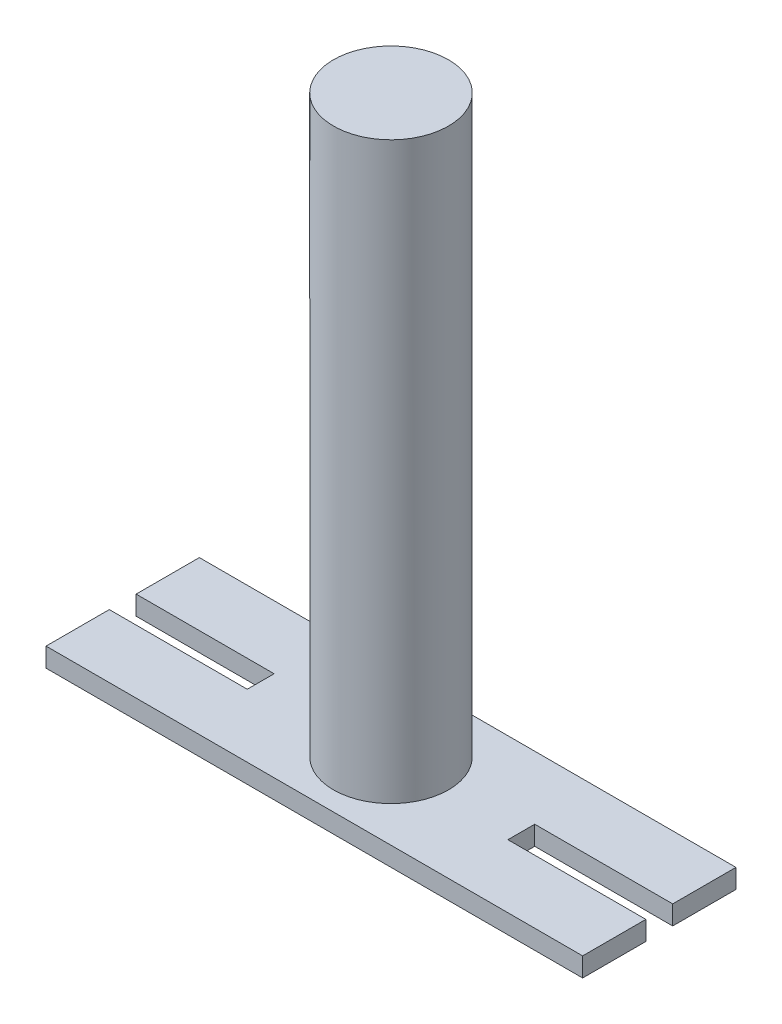
ISO-10303-21;
HEADER;
FILE_DESCRIPTION(('STEP AP214'),'2;1');
FILE_NAME('part.step','',(''),(''),'','','');
FILE_SCHEMA(('AUTOMOTIVE_DESIGN { 1 0 10303 214 1 1 1 1 }'));
ENDSEC;
DATA;
#1=APPLICATION_CONTEXT('core data for automotive mechanical design processes');
#2=APPLICATION_PROTOCOL_DEFINITION('international standard','automotive_design',2000,#1);
#3=PRODUCT_CONTEXT('',#1,'mechanical');
#4=PRODUCT('Part','Part','',(#3));
#5=PRODUCT_RELATED_PRODUCT_CATEGORY('part','',(#4));
#6=PRODUCT_DEFINITION_FORMATION('','',#4);
#7=PRODUCT_DEFINITION_CONTEXT('part definition',#1,'design');
#8=PRODUCT_DEFINITION('design','',#6,#7);
#9=PRODUCT_DEFINITION_SHAPE('','',#8);
#10=(LENGTH_UNIT() NAMED_UNIT(*) SI_UNIT(.MILLI.,.METRE.));
#11=(NAMED_UNIT(*) PLANE_ANGLE_UNIT() SI_UNIT($,.RADIAN.));
#12=(NAMED_UNIT(*) SI_UNIT($,.STERADIAN.) SOLID_ANGLE_UNIT());
#13=UNCERTAINTY_MEASURE_WITH_UNIT(LENGTH_MEASURE(1.E-05),#10,'distance_accuracy_value','');
#14=(GEOMETRIC_REPRESENTATION_CONTEXT(3) GLOBAL_UNCERTAINTY_ASSIGNED_CONTEXT((#13)) GLOBAL_UNIT_ASSIGNED_CONTEXT((#10,
#11,#12)) REPRESENTATION_CONTEXT('',''));
#15=CARTESIAN_POINT('',(0.,0.,0.));
#16=DIRECTION('',(0.,0.,1.));
#17=DIRECTION('',(1.,0.,0.));
#18=AXIS2_PLACEMENT_3D('',#15,#16,#17);
#19=CARTESIAN_POINT('',(0.,127.,0.));
#20=DIRECTION('',(0.,1.,0.));
#21=DIRECTION('',(0.,0.,1.));
#22=AXIS2_PLACEMENT_3D('',#19,#20,#21);
#23=PLANE('',#22);
#24=CARTESIAN_POINT('',(0.,127.,0.));
#25=DIRECTION('',(0.,1.,0.));
#26=DIRECTION('',(0.,0.,1.));
#27=AXIS2_PLACEMENT_3D('',#24,#25,#26);
#28=CIRCLE('',#27,381.);
#29=CARTESIAN_POINT('',(0.,127.,381.));
#30=VERTEX_POINT('',#29);
#31=EDGE_CURVE('E12',#30,#30,#28,.T.);
#32=ORIENTED_EDGE('',*,*,#31,.F.);
#33=EDGE_LOOP('',(#32));
#34=FACE_BOUND('',#33,.T.);
#35=DIRECTION('',(0.,0.,1.));
#36=VECTOR('',#35,1.);
#37=CARTESIAN_POINT('',(1778.,127.,9.42007414833465E-13));
#38=LINE('',#37,#36);
#39=CARTESIAN_POINT('',(1778.,127.,88.8999999999994));
#40=VERTEX_POINT('',#39);
#41=CARTESIAN_POINT('',(1778.,127.,508.));
#42=VERTEX_POINT('',#41);
#43=EDGE_CURVE('E221',#40,#42,#38,.T.);
#44=ORIENTED_EDGE('',*,*,#43,.F.);
#45=DIRECTION('',(-1.,0.,0.));
#46=VECTOR('',#45,1.);
#47=CARTESIAN_POINT('',(0.,127.,88.9000000000002));
#48=LINE('',#47,#46);
#49=CARTESIAN_POINT('',(863.6,127.,88.8999999999998));
#50=VERTEX_POINT('',#49);
#51=EDGE_CURVE('E245',#40,#50,#48,.T.);
#52=ORIENTED_EDGE('',*,*,#51,.T.);
#53=DIRECTION('',(0.,0.,-1.));
#54=VECTOR('',#53,1.);
#55=CARTESIAN_POINT('',(863.6,127.,-1.07850236677872E-12));
#56=LINE('',#55,#54);
#57=CARTESIAN_POINT('',(863.6,127.,-88.9000000000004));
#58=VERTEX_POINT('',#57);
#59=EDGE_CURVE('E313',#50,#58,#56,.T.);
#60=ORIENTED_EDGE('',*,*,#59,.T.);
#61=DIRECTION('',(-1.,0.,0.));
#62=VECTOR('',#61,1.);
#63=CARTESIAN_POINT('',(0.,127.,-88.9000000000004));
#64=LINE('',#63,#62);
#65=CARTESIAN_POINT('',(1778.,127.,-88.9000000000004));
#66=VERTEX_POINT('',#65);
#67=EDGE_CURVE('E309',#66,#58,#64,.T.);
#68=ORIENTED_EDGE('',*,*,#67,.F.);
#69=DIRECTION('',(0.,0.,1.));
#70=VECTOR('',#69,1.);
#71=CARTESIAN_POINT('',(1778.,127.,0.));
#72=LINE('',#71,#70);
#73=CARTESIAN_POINT('',(1778.,127.,-508.));
#74=VERTEX_POINT('',#73);
#75=EDGE_CURVE('E312',#74,#66,#72,.T.);
#76=ORIENTED_EDGE('',*,*,#75,.F.);
#77=DIRECTION('',(-1.,0.,0.));
#78=VECTOR('',#77,1.);
#79=CARTESIAN_POINT('',(0.,127.,-508.));
#80=LINE('',#79,#78);
#81=CARTESIAN_POINT('',(-1778.,127.,-508.));
#82=VERTEX_POINT('',#81);
#83=EDGE_CURVE('E315',#74,#82,#80,.T.);
#84=ORIENTED_EDGE('',*,*,#83,.T.);
#85=DIRECTION('',(0.,0.,1.));
#86=VECTOR('',#85,1.);
#87=CARTESIAN_POINT('',(-1778.,127.,0.));
#88=LINE('',#87,#86);
#89=CARTESIAN_POINT('',(-1778.,127.,-88.9));
#90=VERTEX_POINT('',#89);
#91=EDGE_CURVE('E321',#82,#90,#88,.T.);
#92=ORIENTED_EDGE('',*,*,#91,.T.);
#93=DIRECTION('',(1.,0.,0.));
#94=VECTOR('',#93,1.);
#95=CARTESIAN_POINT('',(0.,127.,-88.9000000000004));
#96=LINE('',#95,#94);
#97=CARTESIAN_POINT('',(-863.6,127.,-88.9000000000002));
#98=VERTEX_POINT('',#97);
#99=EDGE_CURVE('E186',#90,#98,#96,.T.);
#100=ORIENTED_EDGE('',*,*,#99,.T.);
#101=DIRECTION('',(0.,0.,-1.));
#102=VECTOR('',#101,1.);
#103=CARTESIAN_POINT('',(-863.6,127.,0.));
#104=LINE('',#103,#102);
#105=CARTESIAN_POINT('',(-863.6,127.,88.9000000000002));
#106=VERTEX_POINT('',#105);
#107=EDGE_CURVE('E184',#106,#98,#104,.T.);
#108=ORIENTED_EDGE('',*,*,#107,.F.);
#109=DIRECTION('',(1.,0.,0.));
#110=VECTOR('',#109,1.);
#111=CARTESIAN_POINT('',(0.,127.,88.9000000000002));
#112=LINE('',#111,#110);
#113=CARTESIAN_POINT('',(-1778.,127.,88.9000000000002));
#114=VERTEX_POINT('',#113);
#115=EDGE_CURVE('E168',#114,#106,#112,.T.);
#116=ORIENTED_EDGE('',*,*,#115,.F.);
#117=DIRECTION('',(0.,0.,1.));
#118=VECTOR('',#117,1.);
#119=CARTESIAN_POINT('',(-1778.,127.,1.88401482966693E-12));
#120=LINE('',#119,#118);
#121=CARTESIAN_POINT('',(-1778.,127.,508.));
#122=VERTEX_POINT('',#121);
#123=EDGE_CURVE('E175',#114,#122,#120,.T.);
#124=ORIENTED_EDGE('',*,*,#123,.T.);
#125=DIRECTION('',(-1.,0.,0.));
#126=VECTOR('',#125,1.);
#127=CARTESIAN_POINT('',(0.,127.,508.));
#128=LINE('',#127,#126);
#129=EDGE_CURVE('E179',#42,#122,#128,.T.);
#130=ORIENTED_EDGE('',*,*,#129,.F.);
#131=EDGE_LOOP('',(#44,#52,#60,#68,#76,#84,#92,#100,#108,#116,#124,#130));
#132=FACE_BOUND('',#131,.T.);
#133=ADVANCED_FACE('F71',(#34,#132),#23,.T.);
#134=CARTESIAN_POINT('',(0.,0.,0.));
#135=DIRECTION('',(0.,1.,0.));
#136=DIRECTION('',(0.,0.,1.));
#137=AXIS2_PLACEMENT_3D('',#134,#135,#136);
#138=PLANE('',#137);
#139=DIRECTION('',(0.,0.,1.));
#140=VECTOR('',#139,1.);
#141=CARTESIAN_POINT('',(1778.,0.,9.42007414833465E-13));
#142=LINE('',#141,#140);
#143=CARTESIAN_POINT('',(1778.,0.,88.8999999999994));
#144=VERTEX_POINT('',#143);
#145=CARTESIAN_POINT('',(1778.,0.,508.));
#146=VERTEX_POINT('',#145);
#147=EDGE_CURVE('E191',#144,#146,#142,.T.);
#148=ORIENTED_EDGE('',*,*,#147,.T.);
#149=DIRECTION('',(-1.,0.,0.));
#150=VECTOR('',#149,1.);
#151=CARTESIAN_POINT('',(0.,0.,508.));
#152=LINE('',#151,#150);
#153=CARTESIAN_POINT('',(-1778.,0.,508.));
#154=VERTEX_POINT('',#153);
#155=EDGE_CURVE('E218',#146,#154,#152,.T.);
#156=ORIENTED_EDGE('',*,*,#155,.T.);
#157=DIRECTION('',(0.,0.,1.));
#158=VECTOR('',#157,1.);
#159=CARTESIAN_POINT('',(-1778.,0.,1.88401482966693E-12));
#160=LINE('',#159,#158);
#161=CARTESIAN_POINT('',(-1778.,0.,88.9000000000002));
#162=VERTEX_POINT('',#161);
#163=EDGE_CURVE('E216',#162,#154,#160,.T.);
#164=ORIENTED_EDGE('',*,*,#163,.F.);
#165=DIRECTION('',(1.,0.,0.));
#166=VECTOR('',#165,1.);
#167=CARTESIAN_POINT('',(0.,0.,88.9000000000002));
#168=LINE('',#167,#166);
#169=CARTESIAN_POINT('',(-863.6,0.,88.9000000000002));
#170=VERTEX_POINT('',#169);
#171=EDGE_CURVE('E170',#162,#170,#168,.T.);
#172=ORIENTED_EDGE('',*,*,#171,.T.);
#173=DIRECTION('',(0.,0.,-1.));
#174=VECTOR('',#173,1.);
#175=CARTESIAN_POINT('',(-863.6,0.,0.));
#176=LINE('',#175,#174);
#177=CARTESIAN_POINT('',(-863.6,0.,-88.9000000000002));
#178=VERTEX_POINT('',#177);
#179=EDGE_CURVE('E212',#170,#178,#176,.T.);
#180=ORIENTED_EDGE('',*,*,#179,.T.);
#181=DIRECTION('',(1.,0.,0.));
#182=VECTOR('',#181,1.);
#183=CARTESIAN_POINT('',(0.,0.,-88.9000000000004));
#184=LINE('',#183,#182);
#185=CARTESIAN_POINT('',(-1778.,0.,-88.9));
#186=VERTEX_POINT('',#185);
#187=EDGE_CURVE('E209',#186,#178,#184,.T.);
#188=ORIENTED_EDGE('',*,*,#187,.F.);
#189=DIRECTION('',(0.,0.,1.));
#190=VECTOR('',#189,1.);
#191=CARTESIAN_POINT('',(-1778.,0.,0.));
#192=LINE('',#191,#190);
#193=CARTESIAN_POINT('',(-1778.,0.,-508.));
#194=VERTEX_POINT('',#193);
#195=EDGE_CURVE('E207',#194,#186,#192,.T.);
#196=ORIENTED_EDGE('',*,*,#195,.F.);
#197=DIRECTION('',(-1.,0.,0.));
#198=VECTOR('',#197,1.);
#199=CARTESIAN_POINT('',(0.,0.,-508.));
#200=LINE('',#199,#198);
#201=CARTESIAN_POINT('',(1778.,0.,-508.));
#202=VERTEX_POINT('',#201);
#203=EDGE_CURVE('E205',#202,#194,#200,.T.);
#204=ORIENTED_EDGE('',*,*,#203,.F.);
#205=DIRECTION('',(0.,0.,1.));
#206=VECTOR('',#205,1.);
#207=CARTESIAN_POINT('',(1778.,0.,0.));
#208=LINE('',#207,#206);
#209=CARTESIAN_POINT('',(1778.,0.,-88.9000000000004));
#210=VERTEX_POINT('',#209);
#211=EDGE_CURVE('E202',#202,#210,#208,.T.);
#212=ORIENTED_EDGE('',*,*,#211,.T.);
#213=DIRECTION('',(-1.,0.,0.));
#214=VECTOR('',#213,1.);
#215=CARTESIAN_POINT('',(0.,0.,-88.9000000000004));
#216=LINE('',#215,#214);
#217=CARTESIAN_POINT('',(863.6,0.,-88.9000000000004));
#218=VERTEX_POINT('',#217);
#219=EDGE_CURVE('E199',#210,#218,#216,.T.);
#220=ORIENTED_EDGE('',*,*,#219,.T.);
#221=DIRECTION('',(0.,0.,-1.));
#222=VECTOR('',#221,1.);
#223=CARTESIAN_POINT('',(863.6,0.,-1.07850236677872E-12));
#224=LINE('',#223,#222);
#225=CARTESIAN_POINT('',(863.6,0.,88.8999999999998));
#226=VERTEX_POINT('',#225);
#227=EDGE_CURVE('E196',#226,#218,#224,.T.);
#228=ORIENTED_EDGE('',*,*,#227,.F.);
#229=DIRECTION('',(-1.,0.,0.));
#230=VECTOR('',#229,1.);
#231=CARTESIAN_POINT('',(0.,0.,88.9000000000002));
#232=LINE('',#231,#230);
#233=EDGE_CURVE('E193',#144,#226,#232,.T.);
#234=ORIENTED_EDGE('',*,*,#233,.F.);
#235=EDGE_LOOP('',(#148,#156,#164,#172,#180,#188,#196,#204,#212,#220,#228,#234));
#236=FACE_BOUND('',#235,.T.);
#237=CARTESIAN_POINT('',(4.44089209850063E-13,0.,-1.11022302462516E-13));
#238=DIRECTION('',(0.,1.,0.));
#239=DIRECTION('',(0.,0.,1.));
#240=AXIS2_PLACEMENT_3D('',#237,#238,#239);
#241=CIRCLE('',#240,254.);
#242=CARTESIAN_POINT('',(4.44089209850063E-13,0.,254.));
#243=VERTEX_POINT('',#242);
#244=EDGE_CURVE('E194',#243,#243,#241,.T.);
#245=ORIENTED_EDGE('',*,*,#244,.T.);
#246=EDGE_LOOP('',(#245));
#247=FACE_BOUND('',#246,.T.);
#248=ADVANCED_FACE('F248',(#236,#247),#138,.F.);
#249=CARTESIAN_POINT('',(1778.,127.,9.42007414833465E-13));
#250=DIRECTION('',(1.,0.,0.));
#251=DIRECTION('',(0.,0.,-1.));
#252=AXIS2_PLACEMENT_3D('',#249,#250,#251);
#253=PLANE('',#252);
#254=ORIENTED_EDGE('',*,*,#147,.F.);
#255=DIRECTION('',(0.,-1.,0.));
#256=VECTOR('',#255,1.);
#257=CARTESIAN_POINT('',(1778.,127.,88.8999999999994));
#258=LINE('',#257,#256);
#259=EDGE_CURVE('E80',#40,#144,#258,.T.);
#260=ORIENTED_EDGE('',*,*,#259,.F.);
#261=ORIENTED_EDGE('',*,*,#43,.T.);
#262=DIRECTION('',(0.,-1.,0.));
#263=VECTOR('',#262,1.);
#264=CARTESIAN_POINT('',(1778.,127.,508.));
#265=LINE('',#264,#263);
#266=EDGE_CURVE('E88',#42,#146,#265,.T.);
#267=ORIENTED_EDGE('',*,*,#266,.T.);
#268=EDGE_LOOP('',(#254,#260,#261,#267));
#269=FACE_BOUND('',#268,.T.);
#270=ADVANCED_FACE('F73',(#269),#253,.T.);
#271=CARTESIAN_POINT('',(0.,127.,88.9000000000002));
#272=DIRECTION('',(0.,0.,1.));
#273=DIRECTION('',(1.,0.,0.));
#274=AXIS2_PLACEMENT_3D('',#271,#272,#273);
#275=PLANE('',#274);
#276=ORIENTED_EDGE('',*,*,#233,.T.);
#277=DIRECTION('',(0.,-1.,0.));
#278=VECTOR('',#277,1.);
#279=CARTESIAN_POINT('',(863.6,127.,88.8999999999998));
#280=LINE('',#279,#278);
#281=EDGE_CURVE('E239',#50,#226,#280,.T.);
#282=ORIENTED_EDGE('',*,*,#281,.F.);
#283=ORIENTED_EDGE('',*,*,#51,.F.);
#284=ORIENTED_EDGE('',*,*,#259,.T.);
#285=EDGE_LOOP('',(#276,#282,#283,#284));
#286=FACE_BOUND('',#285,.T.);
#287=ADVANCED_FACE('F243',(#286),#275,.F.);
#288=CARTESIAN_POINT('',(863.6,127.,-1.07850236677872E-12));
#289=DIRECTION('',(-1.,0.,0.));
#290=DIRECTION('',(0.,0.,1.));
#291=AXIS2_PLACEMENT_3D('',#288,#289,#290);
#292=PLANE('',#291);
#293=ORIENTED_EDGE('',*,*,#227,.T.);
#294=DIRECTION('',(0.,-1.,0.));
#295=VECTOR('',#294,1.);
#296=CARTESIAN_POINT('',(863.6,127.,-88.9000000000004));
#297=LINE('',#296,#295);
#298=EDGE_CURVE('E237',#58,#218,#297,.T.);
#299=ORIENTED_EDGE('',*,*,#298,.F.);
#300=ORIENTED_EDGE('',*,*,#59,.F.);
#301=ORIENTED_EDGE('',*,*,#281,.T.);
#302=EDGE_LOOP('',(#293,#299,#300,#301));
#303=FACE_BOUND('',#302,.T.);
#304=ADVANCED_FACE('F255',(#303),#292,.F.);
#305=CARTESIAN_POINT('',(0.,127.,-88.9000000000004));
#306=DIRECTION('',(0.,0.,1.));
#307=DIRECTION('',(1.,0.,0.));
#308=AXIS2_PLACEMENT_3D('',#305,#306,#307);
#309=PLANE('',#308);
#310=ORIENTED_EDGE('',*,*,#219,.F.);
#311=DIRECTION('',(0.,-1.,0.));
#312=VECTOR('',#311,1.);
#313=CARTESIAN_POINT('',(1778.,127.,-88.9000000000004));
#314=LINE('',#313,#312);
#315=EDGE_CURVE('E235',#66,#210,#314,.T.);
#316=ORIENTED_EDGE('',*,*,#315,.F.);
#317=ORIENTED_EDGE('',*,*,#67,.T.);
#318=ORIENTED_EDGE('',*,*,#298,.T.);
#319=EDGE_LOOP('',(#310,#316,#317,#318));
#320=FACE_BOUND('',#319,.T.);
#321=ADVANCED_FACE('F293',(#320),#309,.T.);
#322=CARTESIAN_POINT('',(1778.,127.,0.));
#323=DIRECTION('',(1.,0.,0.));
#324=DIRECTION('',(0.,0.,-1.));
#325=AXIS2_PLACEMENT_3D('',#322,#323,#324);
#326=PLANE('',#325);
#327=ORIENTED_EDGE('',*,*,#211,.F.);
#328=DIRECTION('',(0.,-1.,0.));
#329=VECTOR('',#328,1.);
#330=CARTESIAN_POINT('',(1778.,127.,-508.));
#331=LINE('',#330,#329);
#332=EDGE_CURVE('E233',#74,#202,#331,.T.);
#333=ORIENTED_EDGE('',*,*,#332,.F.);
#334=ORIENTED_EDGE('',*,*,#75,.T.);
#335=ORIENTED_EDGE('',*,*,#315,.T.);
#336=EDGE_LOOP('',(#327,#333,#334,#335));
#337=FACE_BOUND('',#336,.T.);
#338=ADVANCED_FACE('F289',(#337),#326,.T.);
#339=CARTESIAN_POINT('',(0.,127.,-508.));
#340=DIRECTION('',(0.,0.,1.));
#341=DIRECTION('',(1.,0.,0.));
#342=AXIS2_PLACEMENT_3D('',#339,#340,#341);
#343=PLANE('',#342);
#344=ORIENTED_EDGE('',*,*,#203,.T.);
#345=DIRECTION('',(0.,-1.,0.));
#346=VECTOR('',#345,1.);
#347=CARTESIAN_POINT('',(-1778.,127.,-508.));
#348=LINE('',#347,#346);
#349=EDGE_CURVE('E230',#82,#194,#348,.T.);
#350=ORIENTED_EDGE('',*,*,#349,.F.);
#351=ORIENTED_EDGE('',*,*,#83,.F.);
#352=ORIENTED_EDGE('',*,*,#332,.T.);
#353=EDGE_LOOP('',(#344,#350,#351,#352));
#354=FACE_BOUND('',#353,.T.);
#355=ADVANCED_FACE('F285',(#354),#343,.F.);
#356=CARTESIAN_POINT('',(-1778.,127.,0.));
#357=DIRECTION('',(1.,0.,0.));
#358=DIRECTION('',(0.,0.,-1.));
#359=AXIS2_PLACEMENT_3D('',#356,#357,#358);
#360=PLANE('',#359);
#361=ORIENTED_EDGE('',*,*,#195,.T.);
#362=DIRECTION('',(0.,-1.,0.));
#363=VECTOR('',#362,1.);
#364=CARTESIAN_POINT('',(-1778.,127.,-88.9));
#365=LINE('',#364,#363);
#366=EDGE_CURVE('E227',#90,#186,#365,.T.);
#367=ORIENTED_EDGE('',*,*,#366,.F.);
#368=ORIENTED_EDGE('',*,*,#91,.F.);
#369=ORIENTED_EDGE('',*,*,#349,.T.);
#370=EDGE_LOOP('',(#361,#367,#368,#369));
#371=FACE_BOUND('',#370,.T.);
#372=ADVANCED_FACE('F281',(#371),#360,.F.);
#373=CARTESIAN_POINT('',(0.,127.,-88.9000000000004));
#374=DIRECTION('',(0.,0.,-1.));
#375=DIRECTION('',(-1.,0.,0.));
#376=AXIS2_PLACEMENT_3D('',#373,#374,#375);
#377=PLANE('',#376);
#378=ORIENTED_EDGE('',*,*,#187,.T.);
#379=DIRECTION('',(0.,-1.,0.));
#380=VECTOR('',#379,1.);
#381=CARTESIAN_POINT('',(-863.6,127.,-88.9000000000002));
#382=LINE('',#381,#380);
#383=EDGE_CURVE('E225',#98,#178,#382,.T.);
#384=ORIENTED_EDGE('',*,*,#383,.F.);
#385=ORIENTED_EDGE('',*,*,#99,.F.);
#386=ORIENTED_EDGE('',*,*,#366,.T.);
#387=EDGE_LOOP('',(#378,#384,#385,#386));
#388=FACE_BOUND('',#387,.T.);
#389=ADVANCED_FACE('F277',(#388),#377,.F.);
#390=CARTESIAN_POINT('',(-863.6,127.,0.));
#391=DIRECTION('',(-1.,0.,0.));
#392=DIRECTION('',(0.,0.,1.));
#393=AXIS2_PLACEMENT_3D('',#390,#391,#392);
#394=PLANE('',#393);
#395=ORIENTED_EDGE('',*,*,#179,.F.);
#396=DIRECTION('',(0.,-1.,0.));
#397=VECTOR('',#396,1.);
#398=CARTESIAN_POINT('',(-863.6,127.,88.9000000000002));
#399=LINE('',#398,#397);
#400=EDGE_CURVE('E173',#106,#170,#399,.T.);
#401=ORIENTED_EDGE('',*,*,#400,.F.);
#402=ORIENTED_EDGE('',*,*,#107,.T.);
#403=ORIENTED_EDGE('',*,*,#383,.T.);
#404=EDGE_LOOP('',(#395,#401,#402,#403));
#405=FACE_BOUND('',#404,.T.);
#406=ADVANCED_FACE('F274',(#405),#394,.T.);
#407=CARTESIAN_POINT('',(0.,127.,88.9000000000002));
#408=DIRECTION('',(0.,0.,-1.));
#409=DIRECTION('',(-1.,0.,0.));
#410=AXIS2_PLACEMENT_3D('',#407,#408,#409);
#411=PLANE('',#410);
#412=ORIENTED_EDGE('',*,*,#171,.F.);
#413=DIRECTION('',(0.,-1.,0.));
#414=VECTOR('',#413,1.);
#415=CARTESIAN_POINT('',(-1778.,127.,88.9000000000002));
#416=LINE('',#415,#414);
#417=EDGE_CURVE('E164',#114,#162,#416,.T.);
#418=ORIENTED_EDGE('',*,*,#417,.F.);
#419=ORIENTED_EDGE('',*,*,#115,.T.);
#420=ORIENTED_EDGE('',*,*,#400,.T.);
#421=EDGE_LOOP('',(#412,#418,#419,#420));
#422=FACE_BOUND('',#421,.T.);
#423=ADVANCED_FACE('F166',(#422),#411,.T.);
#424=CARTESIAN_POINT('',(-1778.,127.,1.88401482966693E-12));
#425=DIRECTION('',(1.,0.,0.));
#426=DIRECTION('',(0.,0.,-1.));
#427=AXIS2_PLACEMENT_3D('',#424,#425,#426);
#428=PLANE('',#427);
#429=ORIENTED_EDGE('',*,*,#163,.T.);
#430=DIRECTION('',(0.,-1.,0.));
#431=VECTOR('',#430,1.);
#432=CARTESIAN_POINT('',(-1778.,127.,508.));
#433=LINE('',#432,#431);
#434=EDGE_CURVE('E127',#122,#154,#433,.T.);
#435=ORIENTED_EDGE('',*,*,#434,.F.);
#436=ORIENTED_EDGE('',*,*,#123,.F.);
#437=ORIENTED_EDGE('',*,*,#417,.T.);
#438=EDGE_LOOP('',(#429,#435,#436,#437));
#439=FACE_BOUND('',#438,.T.);
#440=ADVANCED_FACE('F176',(#439),#428,.F.);
#441=CARTESIAN_POINT('',(0.,127.,508.));
#442=DIRECTION('',(0.,0.,1.));
#443=DIRECTION('',(1.,0.,0.));
#444=AXIS2_PLACEMENT_3D('',#441,#442,#443);
#445=PLANE('',#444);
#446=ORIENTED_EDGE('',*,*,#155,.F.);
#447=ORIENTED_EDGE('',*,*,#266,.F.);
#448=ORIENTED_EDGE('',*,*,#129,.T.);
#449=ORIENTED_EDGE('',*,*,#434,.T.);
#450=EDGE_LOOP('',(#446,#447,#448,#449));
#451=FACE_BOUND('',#450,.T.);
#452=ADVANCED_FACE('F267',(#451),#445,.T.);
#453=CARTESIAN_POINT('',(4.44089209850063E-13,127.,-1.11022302462516E-13));
#454=DIRECTION('',(0.,-1.,0.));
#455=DIRECTION('',(0.,0.,-1.));
#456=AXIS2_PLACEMENT_3D('',#453,#454,#455);
#457=CYLINDRICAL_SURFACE('',#456,254.);
#458=ORIENTED_EDGE('',*,*,#244,.F.);
#459=EDGE_LOOP('',(#458));
#460=FACE_BOUND('',#459,.T.);
#461=CARTESIAN_POINT('',(0.,3810.,0.));
#462=DIRECTION('',(0.,-1.,0.));
#463=DIRECTION('',(0.,0.,-1.));
#464=AXIS2_PLACEMENT_3D('',#461,#462,#463);
#465=CIRCLE('',#464,254.);
#466=CARTESIAN_POINT('',(0.,3810.,-254.));
#467=VERTEX_POINT('',#466);
#468=EDGE_CURVE('E338',#467,#467,#465,.T.);
#469=ORIENTED_EDGE('',*,*,#468,.F.);
#470=EDGE_LOOP('',(#469));
#471=FACE_BOUND('',#470,.T.);
#472=ADVANCED_FACE('F264',(#460,#471),#457,.F.);
#473=CARTESIAN_POINT('',(254.,3810.,0.));
#474=DIRECTION('',(0.,-1.,0.));
#475=DIRECTION('',(0.,0.,-1.));
#476=AXIS2_PLACEMENT_3D('',#473,#474,#475);
#477=PLANE('',#476);
#478=ORIENTED_EDGE('',*,*,#468,.T.);
#479=EDGE_LOOP('',(#478));
#480=FACE_BOUND('',#479,.T.);
#481=ADVANCED_FACE('F342',(#480),#477,.T.);
#482=CARTESIAN_POINT('',(0.,3937.,0.));
#483=DIRECTION('',(0.,1.,0.));
#484=DIRECTION('',(0.,0.,1.));
#485=AXIS2_PLACEMENT_3D('',#482,#483,#484);
#486=PLANE('',#485);
#487=CARTESIAN_POINT('',(0.,3937.,0.));
#488=DIRECTION('',(0.,-1.,0.));
#489=DIRECTION('',(0.,0.,-1.));
#490=AXIS2_PLACEMENT_3D('',#487,#488,#489);
#491=CIRCLE('',#490,381.);
#492=CARTESIAN_POINT('',(0.,3937.,-381.));
#493=VERTEX_POINT('',#492);
#494=EDGE_CURVE('E335',#493,#493,#491,.T.);
#495=ORIENTED_EDGE('',*,*,#494,.F.);
#496=EDGE_LOOP('',(#495));
#497=FACE_BOUND('',#496,.T.);
#498=ADVANCED_FACE('F349',(#497),#486,.T.);
#499=CARTESIAN_POINT('',(0.,0.,0.));
#500=DIRECTION('',(0.,-1.,0.));
#501=DIRECTION('',(0.,0.,-1.));
#502=AXIS2_PLACEMENT_3D('',#499,#500,#501);
#503=CYLINDRICAL_SURFACE('',#502,381.);
#504=ORIENTED_EDGE('',*,*,#494,.T.);
#505=EDGE_LOOP('',(#504));
#506=FACE_BOUND('',#505,.T.);
#507=ORIENTED_EDGE('',*,*,#31,.T.);
#508=EDGE_LOOP('',(#507));
#509=FACE_BOUND('',#508,.T.);
#510=ADVANCED_FACE('F355',(#506,#509),#503,.T.);
#511=CLOSED_SHELL('',(#133,#248,#270,#287,#304,#321,#338,#355,#372,#389,#406,#423,#440,#452,
#472,#481,#498,#510));
#512=MANIFOLD_SOLID_BREP('B2',#511);
#513=ADVANCED_BREP_SHAPE_REPRESENTATION('',(#18,#512),#14);
#514=SHAPE_DEFINITION_REPRESENTATION(#9,#513);
ENDSEC;
END-ISO-10303-21;
